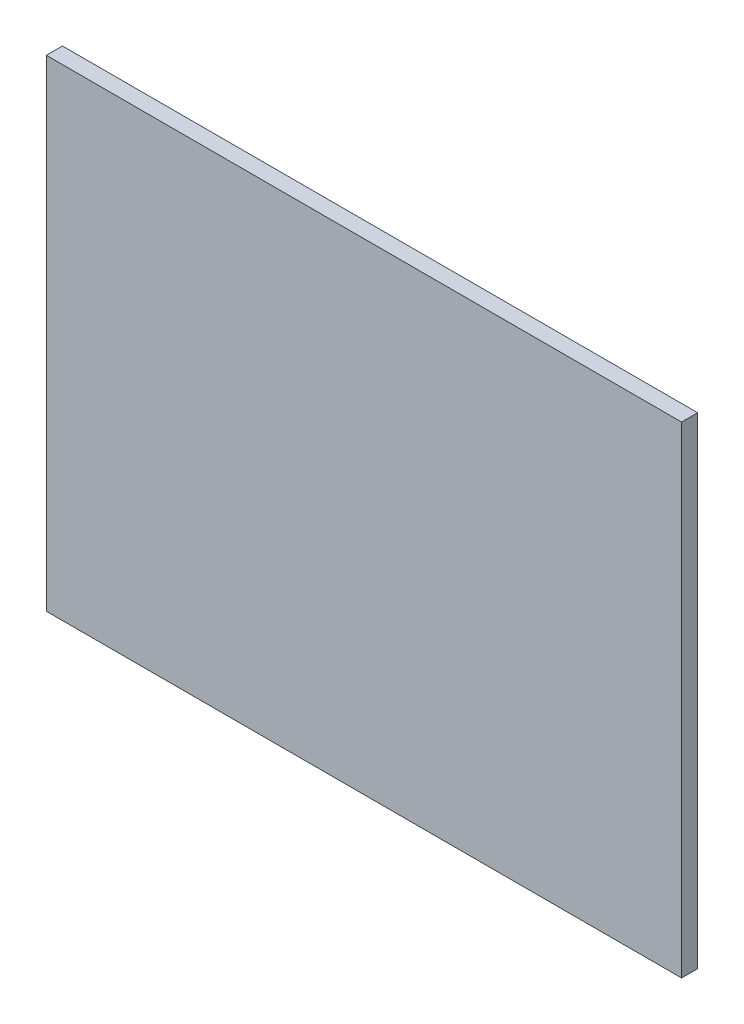
ISO-10303-21;
HEADER;
FILE_DESCRIPTION(('STEP AP214'),'2;1');
FILE_NAME('part.step','',(''),(''),'','','');
FILE_SCHEMA(('AUTOMOTIVE_DESIGN { 1 0 10303 214 1 1 1 1 }'));
ENDSEC;
DATA;
#1=APPLICATION_CONTEXT('core data for automotive mechanical design processes');
#2=APPLICATION_PROTOCOL_DEFINITION('international standard','automotive_design',2000,#1);
#3=PRODUCT_CONTEXT('',#1,'mechanical');
#4=PRODUCT('Part','Part','',(#3));
#5=PRODUCT_RELATED_PRODUCT_CATEGORY('part','',(#4));
#6=PRODUCT_DEFINITION_FORMATION('','',#4);
#7=PRODUCT_DEFINITION_CONTEXT('part definition',#1,'design');
#8=PRODUCT_DEFINITION('design','',#6,#7);
#9=PRODUCT_DEFINITION_SHAPE('','',#8);
#10=(LENGTH_UNIT() NAMED_UNIT(*) SI_UNIT(.MILLI.,.METRE.));
#11=(NAMED_UNIT(*) PLANE_ANGLE_UNIT() SI_UNIT($,.RADIAN.));
#12=(NAMED_UNIT(*) SI_UNIT($,.STERADIAN.) SOLID_ANGLE_UNIT());
#13=UNCERTAINTY_MEASURE_WITH_UNIT(LENGTH_MEASURE(1.E-05),#10,'distance_accuracy_value','');
#14=(GEOMETRIC_REPRESENTATION_CONTEXT(3) GLOBAL_UNCERTAINTY_ASSIGNED_CONTEXT((#13)) GLOBAL_UNIT_ASSIGNED_CONTEXT((#10,
#11,#12)) REPRESENTATION_CONTEXT('',''));
#15=CARTESIAN_POINT('',(0.,0.,0.));
#16=DIRECTION('',(0.,0.,1.));
#17=DIRECTION('',(1.,0.,0.));
#18=AXIS2_PLACEMENT_3D('',#15,#16,#17);
#19=CARTESIAN_POINT('',(1.745,0.,0.05));
#20=DIRECTION('',(-1.,0.,0.));
#21=DIRECTION('',(0.,0.,1.));
#22=AXIS2_PLACEMENT_3D('',#19,#20,#21);
#23=PLANE('',#22);
#24=DIRECTION('',(0.,0.,-1.));
#25=VECTOR('',#24,1.);
#26=CARTESIAN_POINT('',(1.745,-1.495,0.05));
#27=LINE('',#26,#25);
#28=CARTESIAN_POINT('',(1.745,-1.495,0.1));
#29=VERTEX_POINT('',#28);
#30=CARTESIAN_POINT('',(1.745,-1.495,0.));
#31=VERTEX_POINT('',#30);
#32=EDGE_CURVE('E87',#29,#31,#27,.T.);
#33=ORIENTED_EDGE('',*,*,#32,.T.);
#34=DIRECTION('',(0.,-1.,0.));
#35=VECTOR('',#34,1.);
#36=CARTESIAN_POINT('',(1.745,0.,0.));
#37=LINE('',#36,#35);
#38=CARTESIAN_POINT('',(1.745,1.495,0.));
#39=VERTEX_POINT('',#38);
#40=EDGE_CURVE('E84',#39,#31,#37,.T.);
#41=ORIENTED_EDGE('',*,*,#40,.F.);
#42=DIRECTION('',(0.,0.,-1.));
#43=VECTOR('',#42,1.);
#44=CARTESIAN_POINT('',(1.745,1.495,0.05));
#45=LINE('',#44,#43);
#46=CARTESIAN_POINT('',(1.745,1.495,0.1));
#47=VERTEX_POINT('',#46);
#48=EDGE_CURVE('E11',#47,#39,#45,.T.);
#49=ORIENTED_EDGE('',*,*,#48,.F.);
#50=DIRECTION('',(0.,1.,0.));
#51=VECTOR('',#50,1.);
#52=CARTESIAN_POINT('',(1.745,0.,0.1));
#53=LINE('',#52,#51);
#54=EDGE_CURVE('E106',#29,#47,#53,.T.);
#55=ORIENTED_EDGE('',*,*,#54,.F.);
#56=EDGE_LOOP('',(#33,#41,#49,#55));
#57=FACE_BOUND('',#56,.T.);
#58=ADVANCED_FACE('F16',(#57),#23,.F.);
#59=CARTESIAN_POINT('',(-0.2275,1.495,0.05));
#60=DIRECTION('',(0.,-1.,0.));
#61=DIRECTION('',(0.,0.,-1.));
#62=AXIS2_PLACEMENT_3D('',#59,#60,#61);
#63=PLANE('',#62);
#64=ORIENTED_EDGE('',*,*,#48,.T.);
#65=DIRECTION('',(1.,0.,0.));
#66=VECTOR('',#65,1.);
#67=CARTESIAN_POINT('',(-0.2275,1.495,0.));
#68=LINE('',#67,#66);
#69=CARTESIAN_POINT('',(-2.2,1.495,0.));
#70=VERTEX_POINT('',#69);
#71=EDGE_CURVE('E72',#70,#39,#68,.T.);
#72=ORIENTED_EDGE('',*,*,#71,.F.);
#73=DIRECTION('',(0.,0.,-1.));
#74=VECTOR('',#73,1.);
#75=CARTESIAN_POINT('',(-2.2,1.495,0.05));
#76=LINE('',#75,#74);
#77=CARTESIAN_POINT('',(-2.2,1.495,0.1));
#78=VERTEX_POINT('',#77);
#79=EDGE_CURVE('E27',#78,#70,#76,.T.);
#80=ORIENTED_EDGE('',*,*,#79,.F.);
#81=DIRECTION('',(-1.,0.,0.));
#82=VECTOR('',#81,1.);
#83=CARTESIAN_POINT('',(-0.2275,1.495,0.1));
#84=LINE('',#83,#82);
#85=EDGE_CURVE('E75',#47,#78,#84,.T.);
#86=ORIENTED_EDGE('',*,*,#85,.F.);
#87=EDGE_LOOP('',(#64,#72,#80,#86));
#88=FACE_BOUND('',#87,.T.);
#89=ADVANCED_FACE('F71',(#88),#63,.F.);
#90=CARTESIAN_POINT('',(-2.2,0.,0.05));
#91=DIRECTION('',(1.,0.,0.));
#92=DIRECTION('',(0.,1.,0.));
#93=AXIS2_PLACEMENT_3D('',#90,#91,#92);
#94=PLANE('',#93);
#95=ORIENTED_EDGE('',*,*,#79,.T.);
#96=DIRECTION('',(0.,1.,0.));
#97=VECTOR('',#96,1.);
#98=CARTESIAN_POINT('',(-2.2,0.,0.));
#99=LINE('',#98,#97);
#100=CARTESIAN_POINT('',(-2.2,-1.495,0.));
#101=VERTEX_POINT('',#100);
#102=EDGE_CURVE('E20',#101,#70,#99,.T.);
#103=ORIENTED_EDGE('',*,*,#102,.F.);
#104=DIRECTION('',(0.,0.,-1.));
#105=VECTOR('',#104,1.);
#106=CARTESIAN_POINT('',(-2.2,-1.495,0.05));
#107=LINE('',#106,#105);
#108=CARTESIAN_POINT('',(-2.2,-1.495,0.1));
#109=VERTEX_POINT('',#108);
#110=EDGE_CURVE('E64',#109,#101,#107,.T.);
#111=ORIENTED_EDGE('',*,*,#110,.F.);
#112=DIRECTION('',(0.,-1.,0.));
#113=VECTOR('',#112,1.);
#114=CARTESIAN_POINT('',(-2.2,0.,0.1));
#115=LINE('',#114,#113);
#116=EDGE_CURVE('E100',#78,#109,#115,.T.);
#117=ORIENTED_EDGE('',*,*,#116,.F.);
#118=EDGE_LOOP('',(#95,#103,#111,#117));
#119=FACE_BOUND('',#118,.T.);
#120=ADVANCED_FACE('F117',(#119),#94,.F.);
#121=CARTESIAN_POINT('',(-0.2275,-1.495,0.05));
#122=DIRECTION('',(0.,1.,0.));
#123=DIRECTION('',(1.,0.,0.));
#124=AXIS2_PLACEMENT_3D('',#121,#122,#123);
#125=PLANE('',#124);
#126=ORIENTED_EDGE('',*,*,#110,.T.);
#127=DIRECTION('',(-1.,0.,0.));
#128=VECTOR('',#127,1.);
#129=CARTESIAN_POINT('',(-0.2275,-1.495,0.));
#130=LINE('',#129,#128);
#131=EDGE_CURVE('E90',#31,#101,#130,.T.);
#132=ORIENTED_EDGE('',*,*,#131,.F.);
#133=ORIENTED_EDGE('',*,*,#32,.F.);
#134=DIRECTION('',(1.,0.,0.));
#135=VECTOR('',#134,1.);
#136=CARTESIAN_POINT('',(-0.2275,-1.495,0.1));
#137=LINE('',#136,#135);
#138=EDGE_CURVE('E91',#109,#29,#137,.T.);
#139=ORIENTED_EDGE('',*,*,#138,.F.);
#140=EDGE_LOOP('',(#126,#132,#133,#139));
#141=FACE_BOUND('',#140,.T.);
#142=ADVANCED_FACE('F18',(#141),#125,.F.);
#143=CARTESIAN_POINT('',(-0.2275,0.,0.));
#144=DIRECTION('',(0.,0.,1.));
#145=DIRECTION('',(1.,0.,0.));
#146=AXIS2_PLACEMENT_3D('',#143,#144,#145);
#147=PLANE('',#146);
#148=ORIENTED_EDGE('',*,*,#40,.T.);
#149=ORIENTED_EDGE('',*,*,#131,.T.);
#150=ORIENTED_EDGE('',*,*,#102,.T.);
#151=ORIENTED_EDGE('',*,*,#71,.T.);
#152=EDGE_LOOP('',(#148,#149,#150,#151));
#153=FACE_BOUND('',#152,.T.);
#154=ADVANCED_FACE('F82',(#153),#147,.F.);
#155=CARTESIAN_POINT('',(-0.2275,0.,0.1));
#156=DIRECTION('',(0.,0.,1.));
#157=DIRECTION('',(1.,0.,0.));
#158=AXIS2_PLACEMENT_3D('',#155,#156,#157);
#159=PLANE('',#158);
#160=ORIENTED_EDGE('',*,*,#54,.T.);
#161=ORIENTED_EDGE('',*,*,#85,.T.);
#162=ORIENTED_EDGE('',*,*,#116,.T.);
#163=ORIENTED_EDGE('',*,*,#138,.T.);
#164=EDGE_LOOP('',(#160,#161,#162,#163));
#165=FACE_BOUND('',#164,.T.);
#166=ADVANCED_FACE('F157',(#165),#159,.T.);
#167=CLOSED_SHELL('',(#58,#89,#120,#142,#154,#166));
#168=MANIFOLD_SOLID_BREP('B1',#167);
#169=ADVANCED_BREP_SHAPE_REPRESENTATION('',(#18,#168),#14);
#170=SHAPE_DEFINITION_REPRESENTATION(#9,#169);
ENDSEC;
END-ISO-10303-21;
